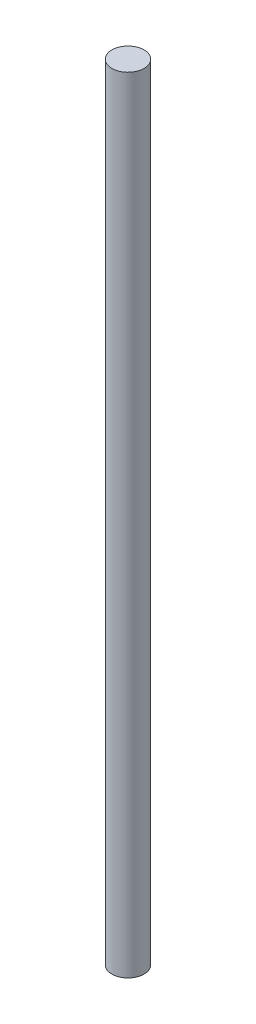
ISO-10303-21;
HEADER;
FILE_DESCRIPTION(('STEP AP214'),'2;1');
FILE_NAME('part.step','',(''),(''),'','','');
FILE_SCHEMA(('AUTOMOTIVE_DESIGN { 1 0 10303 214 1 1 1 1 }'));
ENDSEC;
DATA;
#1=APPLICATION_CONTEXT('core data for automotive mechanical design processes');
#2=APPLICATION_PROTOCOL_DEFINITION('international standard','automotive_design',2000,#1);
#3=PRODUCT_CONTEXT('',#1,'mechanical');
#4=PRODUCT('Part','Part','',(#3));
#5=PRODUCT_RELATED_PRODUCT_CATEGORY('part','',(#4));
#6=PRODUCT_DEFINITION_FORMATION('','',#4);
#7=PRODUCT_DEFINITION_CONTEXT('part definition',#1,'design');
#8=PRODUCT_DEFINITION('design','',#6,#7);
#9=PRODUCT_DEFINITION_SHAPE('','',#8);
#10=(LENGTH_UNIT() NAMED_UNIT(*) SI_UNIT(.MILLI.,.METRE.));
#11=(NAMED_UNIT(*) PLANE_ANGLE_UNIT() SI_UNIT($,.RADIAN.));
#12=(NAMED_UNIT(*) SI_UNIT($,.STERADIAN.) SOLID_ANGLE_UNIT());
#13=UNCERTAINTY_MEASURE_WITH_UNIT(LENGTH_MEASURE(1.E-05),#10,'distance_accuracy_value','');
#14=(GEOMETRIC_REPRESENTATION_CONTEXT(3) GLOBAL_UNCERTAINTY_ASSIGNED_CONTEXT((#13)) GLOBAL_UNIT_ASSIGNED_CONTEXT((#10,
#11,#12)) REPRESENTATION_CONTEXT('',''));
#15=CARTESIAN_POINT('',(0.,0.,0.));
#16=DIRECTION('',(0.,0.,1.));
#17=DIRECTION('',(1.,0.,0.));
#18=AXIS2_PLACEMENT_3D('',#15,#16,#17);
#19=CARTESIAN_POINT('',(0.,195.,0.));
#20=DIRECTION('',(0.,-1.,0.));
#21=DIRECTION('',(0.,0.,-1.));
#22=AXIS2_PLACEMENT_3D('',#19,#20,#21);
#23=CYLINDRICAL_SURFACE('',#22,4.);
#24=CARTESIAN_POINT('',(0.,195.,0.));
#25=DIRECTION('',(0.,1.,0.));
#26=DIRECTION('',(0.,0.,1.));
#27=AXIS2_PLACEMENT_3D('',#24,#25,#26);
#28=CIRCLE('',#27,4.);
#29=CARTESIAN_POINT('',(0.,195.,4.));
#30=VERTEX_POINT('',#29);
#31=EDGE_CURVE('E10',#30,#30,#28,.T.);
#32=ORIENTED_EDGE('',*,*,#31,.F.);
#33=EDGE_LOOP('',(#32));
#34=FACE_BOUND('',#33,.T.);
#35=CARTESIAN_POINT('',(0.,0.,0.));
#36=DIRECTION('',(0.,1.,0.));
#37=DIRECTION('',(0.,0.,1.));
#38=AXIS2_PLACEMENT_3D('',#35,#36,#37);
#39=CIRCLE('',#38,4.);
#40=CARTESIAN_POINT('',(0.,0.,4.));
#41=VERTEX_POINT('',#40);
#42=EDGE_CURVE('E40',#41,#41,#39,.T.);
#43=ORIENTED_EDGE('',*,*,#42,.T.);
#44=EDGE_LOOP('',(#43));
#45=FACE_BOUND('',#44,.T.);
#46=ADVANCED_FACE('F37',(#34,#45),#23,.T.);
#47=CARTESIAN_POINT('',(0.,195.,0.));
#48=DIRECTION('',(0.,1.,0.));
#49=DIRECTION('',(0.,0.,1.));
#50=AXIS2_PLACEMENT_3D('',#47,#48,#49);
#51=PLANE('',#50);
#52=ORIENTED_EDGE('',*,*,#31,.T.);
#53=EDGE_LOOP('',(#52));
#54=FACE_BOUND('',#53,.T.);
#55=ADVANCED_FACE('F52',(#54),#51,.T.);
#56=CARTESIAN_POINT('',(0.,0.,0.));
#57=DIRECTION('',(0.,1.,0.));
#58=DIRECTION('',(0.,0.,1.));
#59=AXIS2_PLACEMENT_3D('',#56,#57,#58);
#60=PLANE('',#59);
#61=ORIENTED_EDGE('',*,*,#42,.F.);
#62=EDGE_LOOP('',(#61));
#63=FACE_BOUND('',#62,.T.);
#64=ADVANCED_FACE('F50',(#63),#60,.F.);
#65=CLOSED_SHELL('',(#46,#55,#64));
#66=MANIFOLD_SOLID_BREP('B2',#65);
#67=ADVANCED_BREP_SHAPE_REPRESENTATION('',(#18,#66),#14);
#68=SHAPE_DEFINITION_REPRESENTATION(#9,#67);
ENDSEC;
END-ISO-10303-21;
